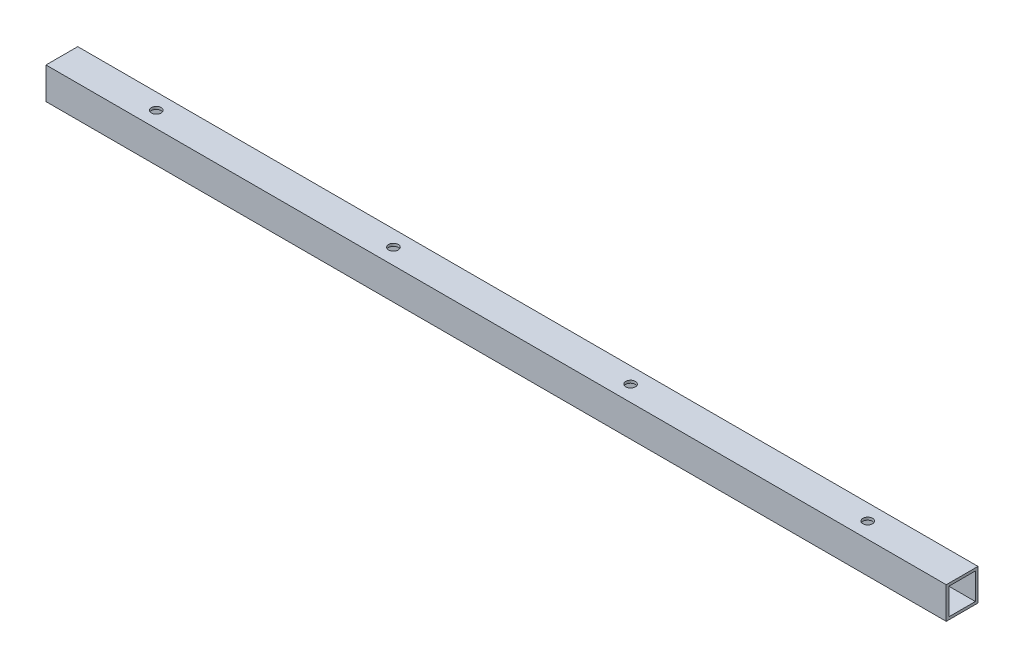
ISO-10303-21;
HEADER;
FILE_DESCRIPTION(('STEP AP214'),'2;1');
FILE_NAME('part.step','',(''),(''),'','','');
FILE_SCHEMA(('AUTOMOTIVE_DESIGN { 1 0 10303 214 1 1 1 1 }'));
ENDSEC;
DATA;
#1=APPLICATION_CONTEXT('core data for automotive mechanical design processes');
#2=APPLICATION_PROTOCOL_DEFINITION('international standard','automotive_design',2000,#1);
#3=PRODUCT_CONTEXT('',#1,'mechanical');
#4=PRODUCT('Part','Part','',(#3));
#5=PRODUCT_RELATED_PRODUCT_CATEGORY('part','',(#4));
#6=PRODUCT_DEFINITION_FORMATION('','',#4);
#7=PRODUCT_DEFINITION_CONTEXT('part definition',#1,'design');
#8=PRODUCT_DEFINITION('design','',#6,#7);
#9=PRODUCT_DEFINITION_SHAPE('','',#8);
#10=(LENGTH_UNIT() NAMED_UNIT(*) SI_UNIT(.MILLI.,.METRE.));
#11=(NAMED_UNIT(*) PLANE_ANGLE_UNIT() SI_UNIT($,.RADIAN.));
#12=(NAMED_UNIT(*) SI_UNIT($,.STERADIAN.) SOLID_ANGLE_UNIT());
#13=UNCERTAINTY_MEASURE_WITH_UNIT(LENGTH_MEASURE(1.E-05),#10,'distance_accuracy_value','');
#14=(GEOMETRIC_REPRESENTATION_CONTEXT(3) GLOBAL_UNCERTAINTY_ASSIGNED_CONTEXT((#13)) GLOBAL_UNIT_ASSIGNED_CONTEXT((#10,
#11,#12)) REPRESENTATION_CONTEXT('',''));
#15=CARTESIAN_POINT('',(0.,0.,0.));
#16=DIRECTION('',(0.,0.,1.));
#17=DIRECTION('',(1.,0.,0.));
#18=AXIS2_PLACEMENT_3D('',#15,#16,#17);
#19=CARTESIAN_POINT('',(483.3366,-9.52500000000001,0.));
#20=DIRECTION('',(0.,1.,0.));
#21=DIRECTION('',(0.,0.,1.));
#22=AXIS2_PLACEMENT_3D('',#19,#20,#21);
#23=CYLINDRICAL_SURFACE('',#22,2.8956);
#24=CARTESIAN_POINT('',(483.3366,7.9375,0.));
#25=DIRECTION('',(0.,-1.,0.));
#26=DIRECTION('',(0.,0.,-1.));
#27=AXIS2_PLACEMENT_3D('',#24,#25,#26);
#28=CIRCLE('',#27,2.8956);
#29=CARTESIAN_POINT('',(483.3366,7.9375,-2.8956));
#30=VERTEX_POINT('',#29);
#31=EDGE_CURVE('E42',#30,#30,#28,.T.);
#32=ORIENTED_EDGE('',*,*,#31,.T.);
#33=EDGE_LOOP('',(#32));
#34=FACE_BOUND('',#33,.T.);
#35=CARTESIAN_POINT('',(483.3366,9.525,0.));
#36=DIRECTION('',(0.,1.,0.));
#37=DIRECTION('',(0.,0.,1.));
#38=AXIS2_PLACEMENT_3D('',#35,#36,#37);
#39=CIRCLE('',#38,2.8956);
#40=CARTESIAN_POINT('',(483.3366,9.525,2.8956));
#41=VERTEX_POINT('',#40);
#42=EDGE_CURVE('E11',#41,#41,#39,.T.);
#43=ORIENTED_EDGE('',*,*,#42,.T.);
#44=EDGE_LOOP('',(#43));
#45=FACE_BOUND('',#44,.T.);
#46=ADVANCED_FACE('F35',(#34,#45),#23,.F.);
#47=CARTESIAN_POINT('',(341.0966,-9.52500000000001,0.));
#48=DIRECTION('',(0.,1.,0.));
#49=DIRECTION('',(0.,0.,1.));
#50=AXIS2_PLACEMENT_3D('',#47,#48,#49);
#51=CYLINDRICAL_SURFACE('',#50,2.8956);
#52=CARTESIAN_POINT('',(341.0966,7.9375,0.));
#53=DIRECTION('',(0.,-1.,0.));
#54=DIRECTION('',(0.,0.,-1.));
#55=AXIS2_PLACEMENT_3D('',#52,#53,#54);
#56=CIRCLE('',#55,2.8956);
#57=CARTESIAN_POINT('',(341.0966,7.9375,-2.8956));
#58=VERTEX_POINT('',#57);
#59=EDGE_CURVE('E184',#58,#58,#56,.T.);
#60=ORIENTED_EDGE('',*,*,#59,.T.);
#61=EDGE_LOOP('',(#60));
#62=FACE_BOUND('',#61,.T.);
#63=CARTESIAN_POINT('',(341.0966,9.525,0.));
#64=DIRECTION('',(0.,1.,0.));
#65=DIRECTION('',(0.,0.,1.));
#66=AXIS2_PLACEMENT_3D('',#63,#64,#65);
#67=CIRCLE('',#66,2.8956);
#68=CARTESIAN_POINT('',(341.0966,9.525,2.8956));
#69=VERTEX_POINT('',#68);
#70=EDGE_CURVE('E187',#69,#69,#67,.T.);
#71=ORIENTED_EDGE('',*,*,#70,.T.);
#72=EDGE_LOOP('',(#71));
#73=FACE_BOUND('',#72,.T.);
#74=ADVANCED_FACE('F209',(#62,#73),#51,.F.);
#75=CARTESIAN_POINT('',(483.3366,-9.52500000000001,0.));
#76=DIRECTION('',(0.,1.,0.));
#77=DIRECTION('',(0.,0.,1.));
#78=AXIS2_PLACEMENT_3D('',#75,#76,#77);
#79=CYLINDRICAL_SURFACE('',#78,2.8956);
#80=CARTESIAN_POINT('',(483.3366,-7.9375,0.));
#81=DIRECTION('',(0.,1.,0.));
#82=DIRECTION('',(0.,0.,1.));
#83=AXIS2_PLACEMENT_3D('',#80,#81,#82);
#84=CIRCLE('',#83,2.8956);
#85=CARTESIAN_POINT('',(483.3366,-7.9375,2.8956));
#86=VERTEX_POINT('',#85);
#87=EDGE_CURVE('E178',#86,#86,#84,.T.);
#88=ORIENTED_EDGE('',*,*,#87,.T.);
#89=EDGE_LOOP('',(#88));
#90=FACE_BOUND('',#89,.T.);
#91=CARTESIAN_POINT('',(483.3366,-9.52500000000001,0.));
#92=DIRECTION('',(0.,1.,0.));
#93=DIRECTION('',(0.,0.,1.));
#94=AXIS2_PLACEMENT_3D('',#91,#92,#93);
#95=CIRCLE('',#94,2.8956);
#96=CARTESIAN_POINT('',(483.3366,-9.52500000000001,2.8956));
#97=VERTEX_POINT('',#96);
#98=EDGE_CURVE('E181',#97,#97,#95,.T.);
#99=ORIENTED_EDGE('',*,*,#98,.F.);
#100=EDGE_LOOP('',(#99));
#101=FACE_BOUND('',#100,.T.);
#102=ADVANCED_FACE('F213',(#90,#101),#79,.F.);
#103=CARTESIAN_POINT('',(341.0966,-9.52500000000001,0.));
#104=DIRECTION('',(0.,1.,0.));
#105=DIRECTION('',(0.,0.,1.));
#106=AXIS2_PLACEMENT_3D('',#103,#104,#105);
#107=CYLINDRICAL_SURFACE('',#106,2.8956);
#108=CARTESIAN_POINT('',(341.0966,-7.9375,0.));
#109=DIRECTION('',(0.,1.,0.));
#110=DIRECTION('',(0.,0.,1.));
#111=AXIS2_PLACEMENT_3D('',#108,#109,#110);
#112=CIRCLE('',#111,2.8956);
#113=CARTESIAN_POINT('',(341.0966,-7.9375,2.8956));
#114=VERTEX_POINT('',#113);
#115=EDGE_CURVE('E168',#114,#114,#112,.T.);
#116=ORIENTED_EDGE('',*,*,#115,.T.);
#117=EDGE_LOOP('',(#116));
#118=FACE_BOUND('',#117,.T.);
#119=CARTESIAN_POINT('',(341.0966,-9.52500000000001,0.));
#120=DIRECTION('',(0.,1.,0.));
#121=DIRECTION('',(0.,0.,1.));
#122=AXIS2_PLACEMENT_3D('',#119,#120,#121);
#123=CIRCLE('',#122,2.8956);
#124=CARTESIAN_POINT('',(341.0966,-9.52500000000001,2.8956));
#125=VERTEX_POINT('',#124);
#126=EDGE_CURVE('E175',#125,#125,#123,.T.);
#127=ORIENTED_EDGE('',*,*,#126,.F.);
#128=EDGE_LOOP('',(#127));
#129=FACE_BOUND('',#128,.T.);
#130=ADVANCED_FACE('F218',(#118,#129),#107,.F.);
#131=CARTESIAN_POINT('',(539.9532,0.,0.));
#132=DIRECTION('',(1.,0.,0.));
#133=DIRECTION('',(0.,0.,-1.));
#134=AXIS2_PLACEMENT_3D('',#131,#132,#133);
#135=PLANE('',#134);
#136=DIRECTION('',(0.,0.,-1.));
#137=VECTOR('',#136,1.);
#138=CARTESIAN_POINT('',(539.9532,-9.525,-9.525));
#139=LINE('',#138,#137);
#140=CARTESIAN_POINT('',(539.9532,-9.525,9.525));
#141=VERTEX_POINT('',#140);
#142=CARTESIAN_POINT('',(539.9532,-9.525,-9.525));
#143=VERTEX_POINT('',#142);
#144=EDGE_CURVE('E139',#141,#143,#139,.T.);
#145=ORIENTED_EDGE('',*,*,#144,.T.);
#146=DIRECTION('',(0.,1.,0.));
#147=VECTOR('',#146,1.);
#148=CARTESIAN_POINT('',(539.9532,9.525,-9.525));
#149=LINE('',#148,#147);
#150=CARTESIAN_POINT('',(539.9532,9.525,-9.525));
#151=VERTEX_POINT('',#150);
#152=EDGE_CURVE('E142',#143,#151,#149,.T.);
#153=ORIENTED_EDGE('',*,*,#152,.T.);
#154=DIRECTION('',(0.,0.,1.));
#155=VECTOR('',#154,1.);
#156=CARTESIAN_POINT('',(539.9532,9.525,-9.525));
#157=LINE('',#156,#155);
#158=CARTESIAN_POINT('',(539.9532,9.525,9.525));
#159=VERTEX_POINT('',#158);
#160=EDGE_CURVE('E145',#151,#159,#157,.T.);
#161=ORIENTED_EDGE('',*,*,#160,.T.);
#162=DIRECTION('',(0.,-1.,0.));
#163=VECTOR('',#162,1.);
#164=CARTESIAN_POINT('',(539.9532,9.525,9.525));
#165=LINE('',#164,#163);
#166=EDGE_CURVE('E147',#159,#141,#165,.T.);
#167=ORIENTED_EDGE('',*,*,#166,.T.);
#168=EDGE_LOOP('',(#145,#153,#161,#167));
#169=FACE_BOUND('',#168,.T.);
#170=DIRECTION('',(0.,1.,0.));
#171=VECTOR('',#170,1.);
#172=CARTESIAN_POINT('',(539.9532,7.9375,-7.9375));
#173=LINE('',#172,#171);
#174=CARTESIAN_POINT('',(539.9532,-7.9375,-7.9375));
#175=VERTEX_POINT('',#174);
#176=CARTESIAN_POINT('',(539.9532,7.9375,-7.9375));
#177=VERTEX_POINT('',#176);
#178=EDGE_CURVE('E108',#175,#177,#173,.T.);
#179=ORIENTED_EDGE('',*,*,#178,.F.);
#180=DIRECTION('',(0.,0.,-1.));
#181=VECTOR('',#180,1.);
#182=CARTESIAN_POINT('',(539.9532,-7.9375,-7.9375));
#183=LINE('',#182,#181);
#184=CARTESIAN_POINT('',(539.9532,-7.9375,7.9375));
#185=VERTEX_POINT('',#184);
#186=EDGE_CURVE('E99',#185,#175,#183,.T.);
#187=ORIENTED_EDGE('',*,*,#186,.F.);
#188=DIRECTION('',(0.,-1.,0.));
#189=VECTOR('',#188,1.);
#190=CARTESIAN_POINT('',(539.9532,7.9375,7.9375));
#191=LINE('',#190,#189);
#192=CARTESIAN_POINT('',(539.9532,7.9375,7.9375));
#193=VERTEX_POINT('',#192);
#194=EDGE_CURVE('E123',#193,#185,#191,.T.);
#195=ORIENTED_EDGE('',*,*,#194,.F.);
#196=DIRECTION('',(0.,0.,1.));
#197=VECTOR('',#196,1.);
#198=CARTESIAN_POINT('',(539.9532,7.9375,-7.9375));
#199=LINE('',#198,#197);
#200=EDGE_CURVE('E121',#177,#193,#199,.T.);
#201=ORIENTED_EDGE('',*,*,#200,.F.);
#202=EDGE_LOOP('',(#179,#187,#195,#201));
#203=FACE_BOUND('',#202,.T.);
#204=ADVANCED_FACE('F120',(#169,#203),#135,.T.);
#205=CARTESIAN_POINT('',(0.,0.,0.));
#206=DIRECTION('',(1.,0.,0.));
#207=DIRECTION('',(0.,0.,-1.));
#208=AXIS2_PLACEMENT_3D('',#205,#206,#207);
#209=PLANE('',#208);
#210=DIRECTION('',(0.,0.,-1.));
#211=VECTOR('',#210,1.);
#212=CARTESIAN_POINT('',(0.,-9.525,-9.525));
#213=LINE('',#212,#211);
#214=CARTESIAN_POINT('',(0.,-9.525,9.525));
#215=VERTEX_POINT('',#214);
#216=CARTESIAN_POINT('',(0.,-9.525,-9.525));
#217=VERTEX_POINT('',#216);
#218=EDGE_CURVE('E116',#215,#217,#213,.T.);
#219=ORIENTED_EDGE('',*,*,#218,.F.);
#220=DIRECTION('',(0.,-1.,0.));
#221=VECTOR('',#220,1.);
#222=CARTESIAN_POINT('',(0.,9.525,9.525));
#223=LINE('',#222,#221);
#224=CARTESIAN_POINT('',(0.,9.525,9.525));
#225=VERTEX_POINT('',#224);
#226=EDGE_CURVE('E143',#225,#215,#223,.T.);
#227=ORIENTED_EDGE('',*,*,#226,.F.);
#228=DIRECTION('',(0.,0.,1.));
#229=VECTOR('',#228,1.);
#230=CARTESIAN_POINT('',(0.,9.525,-9.525));
#231=LINE('',#230,#229);
#232=CARTESIAN_POINT('',(0.,9.525,-9.525));
#233=VERTEX_POINT('',#232);
#234=EDGE_CURVE('E154',#233,#225,#231,.T.);
#235=ORIENTED_EDGE('',*,*,#234,.F.);
#236=DIRECTION('',(0.,1.,0.));
#237=VECTOR('',#236,1.);
#238=CARTESIAN_POINT('',(0.,9.525,-9.525));
#239=LINE('',#238,#237);
#240=EDGE_CURVE('E152',#217,#233,#239,.T.);
#241=ORIENTED_EDGE('',*,*,#240,.F.);
#242=EDGE_LOOP('',(#219,#227,#235,#241));
#243=FACE_BOUND('',#242,.T.);
#244=DIRECTION('',(0.,0.,-1.));
#245=VECTOR('',#244,1.);
#246=CARTESIAN_POINT('',(0.,-7.9375,-7.9375));
#247=LINE('',#246,#245);
#248=CARTESIAN_POINT('',(0.,-7.9375,7.9375));
#249=VERTEX_POINT('',#248);
#250=CARTESIAN_POINT('',(0.,-7.9375,-7.9375));
#251=VERTEX_POINT('',#250);
#252=EDGE_CURVE('E57',#249,#251,#247,.T.);
#253=ORIENTED_EDGE('',*,*,#252,.T.);
#254=DIRECTION('',(0.,1.,0.));
#255=VECTOR('',#254,1.);
#256=CARTESIAN_POINT('',(0.,7.9375,-7.9375));
#257=LINE('',#256,#255);
#258=CARTESIAN_POINT('',(0.,7.9375,-7.9375));
#259=VERTEX_POINT('',#258);
#260=EDGE_CURVE('E115',#251,#259,#257,.T.);
#261=ORIENTED_EDGE('',*,*,#260,.T.);
#262=DIRECTION('',(0.,0.,1.));
#263=VECTOR('',#262,1.);
#264=CARTESIAN_POINT('',(0.,7.9375,-7.9375));
#265=LINE('',#264,#263);
#266=CARTESIAN_POINT('',(0.,7.9375,7.9375));
#267=VERTEX_POINT('',#266);
#268=EDGE_CURVE('E131',#259,#267,#265,.T.);
#269=ORIENTED_EDGE('',*,*,#268,.T.);
#270=DIRECTION('',(0.,-1.,0.));
#271=VECTOR('',#270,1.);
#272=CARTESIAN_POINT('',(0.,7.9375,7.9375));
#273=LINE('',#272,#271);
#274=EDGE_CURVE('E109',#267,#249,#273,.T.);
#275=ORIENTED_EDGE('',*,*,#274,.T.);
#276=EDGE_LOOP('',(#253,#261,#269,#275));
#277=FACE_BOUND('',#276,.T.);
#278=ADVANCED_FACE('F230',(#243,#277),#209,.F.);
#279=CARTESIAN_POINT('',(539.9532,-9.525,-9.525));
#280=DIRECTION('',(0.,1.,0.));
#281=DIRECTION('',(0.,0.,1.));
#282=AXIS2_PLACEMENT_3D('',#279,#280,#281);
#283=PLANE('',#282);
#284=CARTESIAN_POINT('',(198.8566,-9.52500000000001,0.));
#285=DIRECTION('',(0.,1.,0.));
#286=DIRECTION('',(0.,0.,1.));
#287=AXIS2_PLACEMENT_3D('',#284,#285,#286);
#288=CIRCLE('',#287,2.8956);
#289=CARTESIAN_POINT('',(198.8566,-9.52500000000001,2.8956));
#290=VERTEX_POINT('',#289);
#291=EDGE_CURVE('E264',#290,#290,#288,.T.);
#292=ORIENTED_EDGE('',*,*,#291,.T.);
#293=EDGE_LOOP('',(#292));
#294=FACE_BOUND('',#293,.T.);
#295=CARTESIAN_POINT('',(56.6166,-9.52500000000001,0.));
#296=DIRECTION('',(0.,1.,0.));
#297=DIRECTION('',(0.,0.,1.));
#298=AXIS2_PLACEMENT_3D('',#295,#296,#297);
#299=CIRCLE('',#298,2.8956);
#300=CARTESIAN_POINT('',(56.6166,-9.52500000000001,2.8956));
#301=VERTEX_POINT('',#300);
#302=EDGE_CURVE('E172',#301,#301,#299,.T.);
#303=ORIENTED_EDGE('',*,*,#302,.T.);
#304=EDGE_LOOP('',(#303));
#305=FACE_BOUND('',#304,.T.);
#306=ORIENTED_EDGE('',*,*,#218,.T.);
#307=DIRECTION('',(-1.,0.,0.));
#308=VECTOR('',#307,1.);
#309=CARTESIAN_POINT('',(539.9532,-9.525,-9.525));
#310=LINE('',#309,#308);
#311=EDGE_CURVE('E165',#143,#217,#310,.T.);
#312=ORIENTED_EDGE('',*,*,#311,.F.);
#313=ORIENTED_EDGE('',*,*,#144,.F.);
#314=DIRECTION('',(-1.,0.,0.));
#315=VECTOR('',#314,1.);
#316=CARTESIAN_POINT('',(539.9532,-9.525,9.525));
#317=LINE('',#316,#315);
#318=EDGE_CURVE('E149',#141,#215,#317,.T.);
#319=ORIENTED_EDGE('',*,*,#318,.T.);
#320=EDGE_LOOP('',(#306,#312,#313,#319));
#321=FACE_BOUND('',#320,.T.);
#322=ORIENTED_EDGE('',*,*,#126,.T.);
#323=EDGE_LOOP('',(#322));
#324=FACE_BOUND('',#323,.T.);
#325=ORIENTED_EDGE('',*,*,#98,.T.);
#326=EDGE_LOOP('',(#325));
#327=FACE_BOUND('',#326,.T.);
#328=ADVANCED_FACE('F226',(#294,#305,#321,#324,#327),#283,.F.);
#329=CARTESIAN_POINT('',(539.9532,9.525,-9.525));
#330=DIRECTION('',(0.,0.,1.));
#331=DIRECTION('',(1.,0.,0.));
#332=AXIS2_PLACEMENT_3D('',#329,#330,#331);
#333=PLANE('',#332);
#334=ORIENTED_EDGE('',*,*,#240,.T.);
#335=DIRECTION('',(-1.,0.,0.));
#336=VECTOR('',#335,1.);
#337=CARTESIAN_POINT('',(539.9532,9.525,-9.525));
#338=LINE('',#337,#336);
#339=EDGE_CURVE('E162',#151,#233,#338,.T.);
#340=ORIENTED_EDGE('',*,*,#339,.F.);
#341=ORIENTED_EDGE('',*,*,#152,.F.);
#342=ORIENTED_EDGE('',*,*,#311,.T.);
#343=EDGE_LOOP('',(#334,#340,#341,#342));
#344=FACE_BOUND('',#343,.T.);
#345=ADVANCED_FACE('F229',(#344),#333,.F.);
#346=CARTESIAN_POINT('',(539.9532,9.525,-9.525));
#347=DIRECTION('',(0.,-1.,0.));
#348=DIRECTION('',(0.,0.,-1.));
#349=AXIS2_PLACEMENT_3D('',#346,#347,#348);
#350=PLANE('',#349);
#351=CARTESIAN_POINT('',(198.8566,9.525,0.));
#352=DIRECTION('',(0.,1.,0.));
#353=DIRECTION('',(0.,0.,1.));
#354=AXIS2_PLACEMENT_3D('',#351,#352,#353);
#355=CIRCLE('',#354,2.8956);
#356=CARTESIAN_POINT('',(198.8566,9.525,2.8956));
#357=VERTEX_POINT('',#356);
#358=EDGE_CURVE('E270',#357,#357,#355,.T.);
#359=ORIENTED_EDGE('',*,*,#358,.F.);
#360=EDGE_LOOP('',(#359));
#361=FACE_BOUND('',#360,.T.);
#362=CARTESIAN_POINT('',(56.6166,9.525,0.));
#363=DIRECTION('',(0.,1.,0.));
#364=DIRECTION('',(0.,0.,1.));
#365=AXIS2_PLACEMENT_3D('',#362,#363,#364);
#366=CIRCLE('',#365,2.8956);
#367=CARTESIAN_POINT('',(56.6166,9.525,2.8956));
#368=VERTEX_POINT('',#367);
#369=EDGE_CURVE('E261',#368,#368,#366,.T.);
#370=ORIENTED_EDGE('',*,*,#369,.F.);
#371=EDGE_LOOP('',(#370));
#372=FACE_BOUND('',#371,.T.);
#373=ORIENTED_EDGE('',*,*,#234,.T.);
#374=DIRECTION('',(-1.,0.,0.));
#375=VECTOR('',#374,1.);
#376=CARTESIAN_POINT('',(539.9532,9.525,9.525));
#377=LINE('',#376,#375);
#378=EDGE_CURVE('E159',#159,#225,#377,.T.);
#379=ORIENTED_EDGE('',*,*,#378,.F.);
#380=ORIENTED_EDGE('',*,*,#160,.F.);
#381=ORIENTED_EDGE('',*,*,#339,.T.);
#382=EDGE_LOOP('',(#373,#379,#380,#381));
#383=FACE_BOUND('',#382,.T.);
#384=ORIENTED_EDGE('',*,*,#70,.F.);
#385=EDGE_LOOP('',(#384));
#386=FACE_BOUND('',#385,.T.);
#387=ORIENTED_EDGE('',*,*,#42,.F.);
#388=EDGE_LOOP('',(#387));
#389=FACE_BOUND('',#388,.T.);
#390=ADVANCED_FACE('F234',(#361,#372,#383,#386,#389),#350,.F.);
#391=CARTESIAN_POINT('',(539.9532,9.525,9.525));
#392=DIRECTION('',(0.,0.,-1.));
#393=DIRECTION('',(-1.,0.,0.));
#394=AXIS2_PLACEMENT_3D('',#391,#392,#393);
#395=PLANE('',#394);
#396=ORIENTED_EDGE('',*,*,#226,.T.);
#397=ORIENTED_EDGE('',*,*,#318,.F.);
#398=ORIENTED_EDGE('',*,*,#166,.F.);
#399=ORIENTED_EDGE('',*,*,#378,.T.);
#400=EDGE_LOOP('',(#396,#397,#398,#399));
#401=FACE_BOUND('',#400,.T.);
#402=ADVANCED_FACE('F238',(#401),#395,.F.);
#403=CARTESIAN_POINT('',(539.9532,-7.9375,-7.9375));
#404=DIRECTION('',(0.,1.,0.));
#405=DIRECTION('',(0.,0.,1.));
#406=AXIS2_PLACEMENT_3D('',#403,#404,#405);
#407=PLANE('',#406);
#408=CARTESIAN_POINT('',(198.8566,-7.9375,0.));
#409=DIRECTION('',(0.,1.,0.));
#410=DIRECTION('',(0.,0.,1.));
#411=AXIS2_PLACEMENT_3D('',#408,#409,#410);
#412=CIRCLE('',#411,2.8956);
#413=CARTESIAN_POINT('',(198.8566,-7.9375,2.8956));
#414=VERTEX_POINT('',#413);
#415=EDGE_CURVE('E256',#414,#414,#412,.T.);
#416=ORIENTED_EDGE('',*,*,#415,.F.);
#417=EDGE_LOOP('',(#416));
#418=FACE_BOUND('',#417,.T.);
#419=CARTESIAN_POINT('',(56.6166,-7.9375,0.));
#420=DIRECTION('',(0.,1.,0.));
#421=DIRECTION('',(0.,0.,1.));
#422=AXIS2_PLACEMENT_3D('',#419,#420,#421);
#423=CIRCLE('',#422,2.8956);
#424=CARTESIAN_POINT('',(56.6166,-7.9375,2.8956));
#425=VERTEX_POINT('',#424);
#426=EDGE_CURVE('E129',#425,#425,#423,.T.);
#427=ORIENTED_EDGE('',*,*,#426,.F.);
#428=EDGE_LOOP('',(#427));
#429=FACE_BOUND('',#428,.T.);
#430=ORIENTED_EDGE('',*,*,#252,.F.);
#431=DIRECTION('',(-1.,0.,0.));
#432=VECTOR('',#431,1.);
#433=CARTESIAN_POINT('',(539.9532,-7.9375,7.9375));
#434=LINE('',#433,#432);
#435=EDGE_CURVE('E104',#185,#249,#434,.T.);
#436=ORIENTED_EDGE('',*,*,#435,.F.);
#437=ORIENTED_EDGE('',*,*,#186,.T.);
#438=DIRECTION('',(-1.,0.,0.));
#439=VECTOR('',#438,1.);
#440=CARTESIAN_POINT('',(539.9532,-7.9375,-7.9375));
#441=LINE('',#440,#439);
#442=EDGE_CURVE('E103',#175,#251,#441,.T.);
#443=ORIENTED_EDGE('',*,*,#442,.T.);
#444=EDGE_LOOP('',(#430,#436,#437,#443));
#445=FACE_BOUND('',#444,.T.);
#446=ORIENTED_EDGE('',*,*,#115,.F.);
#447=EDGE_LOOP('',(#446));
#448=FACE_BOUND('',#447,.T.);
#449=ORIENTED_EDGE('',*,*,#87,.F.);
#450=EDGE_LOOP('',(#449));
#451=FACE_BOUND('',#450,.T.);
#452=ADVANCED_FACE('F101',(#418,#429,#445,#448,#451),#407,.T.);
#453=CARTESIAN_POINT('',(539.9532,7.9375,-7.9375));
#454=DIRECTION('',(0.,0.,1.));
#455=DIRECTION('',(1.,0.,0.));
#456=AXIS2_PLACEMENT_3D('',#453,#454,#455);
#457=PLANE('',#456);
#458=ORIENTED_EDGE('',*,*,#260,.F.);
#459=ORIENTED_EDGE('',*,*,#442,.F.);
#460=ORIENTED_EDGE('',*,*,#178,.T.);
#461=DIRECTION('',(-1.,0.,0.));
#462=VECTOR('',#461,1.);
#463=CARTESIAN_POINT('',(539.9532,7.9375,-7.9375));
#464=LINE('',#463,#462);
#465=EDGE_CURVE('E117',#177,#259,#464,.T.);
#466=ORIENTED_EDGE('',*,*,#465,.T.);
#467=EDGE_LOOP('',(#458,#459,#460,#466));
#468=FACE_BOUND('',#467,.T.);
#469=ADVANCED_FACE('F112',(#468),#457,.T.);
#470=CARTESIAN_POINT('',(539.9532,7.9375,-7.9375));
#471=DIRECTION('',(0.,-1.,0.));
#472=DIRECTION('',(0.,0.,-1.));
#473=AXIS2_PLACEMENT_3D('',#470,#471,#472);
#474=PLANE('',#473);
#475=CARTESIAN_POINT('',(198.8566,7.9375,0.));
#476=DIRECTION('',(0.,-1.,0.));
#477=DIRECTION('',(0.,0.,-1.));
#478=AXIS2_PLACEMENT_3D('',#475,#476,#477);
#479=CIRCLE('',#478,2.8956);
#480=CARTESIAN_POINT('',(198.8566,7.9375,-2.8956));
#481=VERTEX_POINT('',#480);
#482=EDGE_CURVE('E273',#481,#481,#479,.T.);
#483=ORIENTED_EDGE('',*,*,#482,.F.);
#484=EDGE_LOOP('',(#483));
#485=FACE_BOUND('',#484,.T.);
#486=CARTESIAN_POINT('',(56.6166,7.9375,0.));
#487=DIRECTION('',(0.,-1.,0.));
#488=DIRECTION('',(0.,0.,-1.));
#489=AXIS2_PLACEMENT_3D('',#486,#487,#488);
#490=CIRCLE('',#489,2.8956);
#491=CARTESIAN_POINT('',(56.6166,7.9375,-2.8956));
#492=VERTEX_POINT('',#491);
#493=EDGE_CURVE('E169',#492,#492,#490,.T.);
#494=ORIENTED_EDGE('',*,*,#493,.F.);
#495=EDGE_LOOP('',(#494));
#496=FACE_BOUND('',#495,.T.);
#497=ORIENTED_EDGE('',*,*,#268,.F.);
#498=ORIENTED_EDGE('',*,*,#465,.F.);
#499=ORIENTED_EDGE('',*,*,#200,.T.);
#500=DIRECTION('',(-1.,0.,0.));
#501=VECTOR('',#500,1.);
#502=CARTESIAN_POINT('',(539.9532,7.9375,7.9375));
#503=LINE('',#502,#501);
#504=EDGE_CURVE('E49',#193,#267,#503,.T.);
#505=ORIENTED_EDGE('',*,*,#504,.T.);
#506=EDGE_LOOP('',(#497,#498,#499,#505));
#507=FACE_BOUND('',#506,.T.);
#508=ORIENTED_EDGE('',*,*,#59,.F.);
#509=EDGE_LOOP('',(#508));
#510=FACE_BOUND('',#509,.T.);
#511=ORIENTED_EDGE('',*,*,#31,.F.);
#512=EDGE_LOOP('',(#511));
#513=FACE_BOUND('',#512,.T.);
#514=ADVANCED_FACE('F194',(#485,#496,#507,#510,#513),#474,.T.);
#515=CARTESIAN_POINT('',(539.9532,7.9375,7.9375));
#516=DIRECTION('',(0.,0.,-1.));
#517=DIRECTION('',(-1.,0.,0.));
#518=AXIS2_PLACEMENT_3D('',#515,#516,#517);
#519=PLANE('',#518);
#520=ORIENTED_EDGE('',*,*,#274,.F.);
#521=ORIENTED_EDGE('',*,*,#504,.F.);
#522=ORIENTED_EDGE('',*,*,#194,.T.);
#523=ORIENTED_EDGE('',*,*,#435,.T.);
#524=EDGE_LOOP('',(#520,#521,#522,#523));
#525=FACE_BOUND('',#524,.T.);
#526=ADVANCED_FACE('F196',(#525),#519,.T.);
#527=CARTESIAN_POINT('',(56.6166,-9.52500000000001,0.));
#528=DIRECTION('',(0.,1.,0.));
#529=DIRECTION('',(0.,0.,1.));
#530=AXIS2_PLACEMENT_3D('',#527,#528,#529);
#531=CYLINDRICAL_SURFACE('',#530,2.8956);
#532=ORIENTED_EDGE('',*,*,#493,.T.);
#533=EDGE_LOOP('',(#532));
#534=FACE_BOUND('',#533,.T.);
#535=ORIENTED_EDGE('',*,*,#369,.T.);
#536=EDGE_LOOP('',(#535));
#537=FACE_BOUND('',#536,.T.);
#538=ADVANCED_FACE('F203',(#534,#537),#531,.F.);
#539=ORIENTED_EDGE('',*,*,#426,.T.);
#540=EDGE_LOOP('',(#539));
#541=FACE_BOUND('',#540,.T.);
#542=ORIENTED_EDGE('',*,*,#302,.F.);
#543=EDGE_LOOP('',(#542));
#544=FACE_BOUND('',#543,.T.);
#545=ADVANCED_FACE('F313',(#541,#544),#531,.F.);
#546=CARTESIAN_POINT('',(198.8566,-9.52500000000001,0.));
#547=DIRECTION('',(0.,1.,0.));
#548=DIRECTION('',(0.,0.,1.));
#549=AXIS2_PLACEMENT_3D('',#546,#547,#548);
#550=CYLINDRICAL_SURFACE('',#549,2.8956);
#551=ORIENTED_EDGE('',*,*,#415,.T.);
#552=EDGE_LOOP('',(#551));
#553=FACE_BOUND('',#552,.T.);
#554=ORIENTED_EDGE('',*,*,#291,.F.);
#555=EDGE_LOOP('',(#554));
#556=FACE_BOUND('',#555,.T.);
#557=ADVANCED_FACE('F279',(#553,#556),#550,.F.);
#558=CARTESIAN_POINT('',(198.8566,-9.52500000000001,0.));
#559=DIRECTION('',(0.,1.,0.));
#560=DIRECTION('',(0.,0.,1.));
#561=AXIS2_PLACEMENT_3D('',#558,#559,#560);
#562=CYLINDRICAL_SURFACE('',#561,2.8956);
#563=ORIENTED_EDGE('',*,*,#482,.T.);
#564=EDGE_LOOP('',(#563));
#565=FACE_BOUND('',#564,.T.);
#566=ORIENTED_EDGE('',*,*,#358,.T.);
#567=EDGE_LOOP('',(#566));
#568=FACE_BOUND('',#567,.T.);
#569=ADVANCED_FACE('F276',(#565,#568),#562,.F.);
#570=CLOSED_SHELL('',(#46,#74,#102,#130,#204,#278,#328,#345,#390,#402,#452,#469,#514,#526,#538,
#545,#557,#569));
#571=MANIFOLD_SOLID_BREP('B2',#570);
#572=ADVANCED_BREP_SHAPE_REPRESENTATION('',(#18,#571),#14);
#573=SHAPE_DEFINITION_REPRESENTATION(#9,#572);
ENDSEC;
END-ISO-10303-21;
